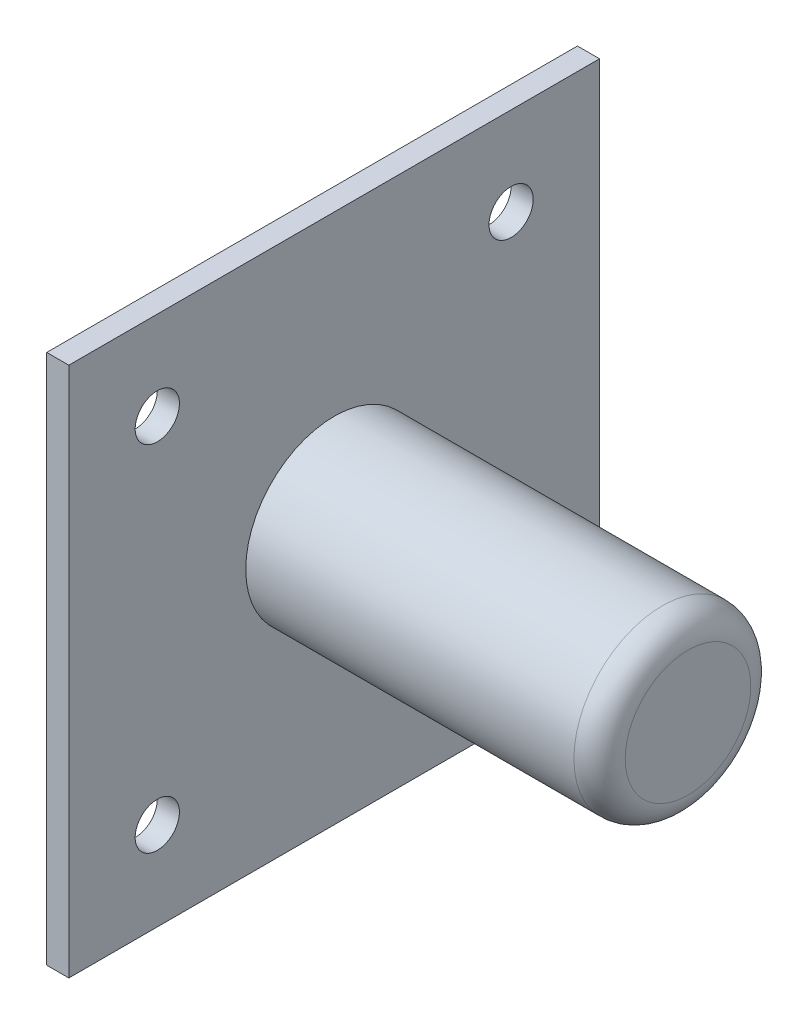
ISO-10303-21;
HEADER;
FILE_DESCRIPTION(('STEP AP214'),'2;1');
FILE_NAME('part.step','',(''),(''),'','','');
FILE_SCHEMA(('AUTOMOTIVE_DESIGN { 1 0 10303 214 1 1 1 1 }'));
ENDSEC;
DATA;
#1=APPLICATION_CONTEXT('core data for automotive mechanical design processes');
#2=APPLICATION_PROTOCOL_DEFINITION('international standard','automotive_design',2000,#1);
#3=PRODUCT_CONTEXT('',#1,'mechanical');
#4=PRODUCT('Part','Part','',(#3));
#5=PRODUCT_RELATED_PRODUCT_CATEGORY('part','',(#4));
#6=PRODUCT_DEFINITION_FORMATION('','',#4);
#7=PRODUCT_DEFINITION_CONTEXT('part definition',#1,'design');
#8=PRODUCT_DEFINITION('design','',#6,#7);
#9=PRODUCT_DEFINITION_SHAPE('','',#8);
#10=(LENGTH_UNIT() NAMED_UNIT(*) SI_UNIT(.MILLI.,.METRE.));
#11=(NAMED_UNIT(*) PLANE_ANGLE_UNIT() SI_UNIT($,.RADIAN.));
#12=(NAMED_UNIT(*) SI_UNIT($,.STERADIAN.) SOLID_ANGLE_UNIT());
#13=UNCERTAINTY_MEASURE_WITH_UNIT(LENGTH_MEASURE(1.E-05),#10,'distance_accuracy_value','');
#14=(GEOMETRIC_REPRESENTATION_CONTEXT(3) GLOBAL_UNCERTAINTY_ASSIGNED_CONTEXT((#13)) GLOBAL_UNIT_ASSIGNED_CONTEXT((#10,
#11,#12)) REPRESENTATION_CONTEXT('',''));
#15=CARTESIAN_POINT('',(0.,0.,0.));
#16=DIRECTION('',(0.,0.,1.));
#17=DIRECTION('',(1.,0.,0.));
#18=AXIS2_PLACEMENT_3D('',#15,#16,#17);
#19=CARTESIAN_POINT('',(1.5875,38.1,-38.1));
#20=DIRECTION('',(-1.,0.,0.));
#21=DIRECTION('',(0.,0.,1.));
#22=AXIS2_PLACEMENT_3D('',#19,#20,#21);
#23=PLANE('',#22);
#24=CARTESIAN_POINT('',(1.5875,0.,0.));
#25=DIRECTION('',(-1.,0.,0.));
#26=DIRECTION('',(0.,0.,1.));
#27=AXIS2_PLACEMENT_3D('',#24,#25,#26);
#28=CIRCLE('',#27,12.7);
#29=CARTESIAN_POINT('',(1.5875,0.,12.7));
#30=VERTEX_POINT('',#29);
#31=EDGE_CURVE('E176',#30,#30,#28,.T.);
#32=ORIENTED_EDGE('',*,*,#31,.T.);
#33=EDGE_LOOP('',(#32));
#34=FACE_BOUND('',#33,.T.);
#35=CARTESIAN_POINT('',(1.5875,-25.4,-25.4));
#36=DIRECTION('',(1.,0.,0.));
#37=DIRECTION('',(0.,0.,-1.));
#38=AXIS2_PLACEMENT_3D('',#35,#36,#37);
#39=CIRCLE('',#38,3.175);
#40=CARTESIAN_POINT('',(1.5875,-25.4,-28.575));
#41=VERTEX_POINT('',#40);
#42=EDGE_CURVE('E150',#41,#41,#39,.T.);
#43=ORIENTED_EDGE('',*,*,#42,.F.);
#44=EDGE_LOOP('',(#43));
#45=FACE_BOUND('',#44,.T.);
#46=CARTESIAN_POINT('',(1.5875,25.4,25.4));
#47=DIRECTION('',(1.,0.,0.));
#48=DIRECTION('',(0.,0.,-1.));
#49=AXIS2_PLACEMENT_3D('',#46,#47,#48);
#50=CIRCLE('',#49,3.175);
#51=CARTESIAN_POINT('',(1.5875,25.4,22.225));
#52=VERTEX_POINT('',#51);
#53=EDGE_CURVE('E120',#52,#52,#50,.T.);
#54=ORIENTED_EDGE('',*,*,#53,.F.);
#55=EDGE_LOOP('',(#54));
#56=FACE_BOUND('',#55,.T.);
#57=DIRECTION('',(0.,1.,0.));
#58=VECTOR('',#57,1.);
#59=CARTESIAN_POINT('',(1.5875,-38.1,-38.1));
#60=LINE('',#59,#58);
#61=CARTESIAN_POINT('',(1.5875,-38.1,-38.1));
#62=VERTEX_POINT('',#61);
#63=CARTESIAN_POINT('',(1.5875,38.1,-38.1));
#64=VERTEX_POINT('',#63);
#65=EDGE_CURVE('E99',#62,#64,#60,.T.);
#66=ORIENTED_EDGE('',*,*,#65,.T.);
#67=DIRECTION('',(0.,0.,1.));
#68=VECTOR('',#67,1.);
#69=CARTESIAN_POINT('',(1.5875,38.1,38.1));
#70=LINE('',#69,#68);
#71=CARTESIAN_POINT('',(1.5875,38.1,38.1));
#72=VERTEX_POINT('',#71);
#73=EDGE_CURVE('E93',#64,#72,#70,.T.);
#74=ORIENTED_EDGE('',*,*,#73,.T.);
#75=DIRECTION('',(0.,-1.,0.));
#76=VECTOR('',#75,1.);
#77=CARTESIAN_POINT('',(1.5875,-38.1,38.1));
#78=LINE('',#77,#76);
#79=CARTESIAN_POINT('',(1.5875,-38.1,38.1));
#80=VERTEX_POINT('',#79);
#81=EDGE_CURVE('E97',#72,#80,#78,.T.);
#82=ORIENTED_EDGE('',*,*,#81,.T.);
#83=DIRECTION('',(0.,0.,-1.));
#84=VECTOR('',#83,1.);
#85=CARTESIAN_POINT('',(1.5875,-38.1,38.1));
#86=LINE('',#85,#84);
#87=EDGE_CURVE('E61',#80,#62,#86,.T.);
#88=ORIENTED_EDGE('',*,*,#87,.T.);
#89=EDGE_LOOP('',(#66,#74,#82,#88));
#90=FACE_BOUND('',#89,.T.);
#91=CARTESIAN_POINT('',(1.5875,25.4,-25.4));
#92=DIRECTION('',(1.,0.,0.));
#93=DIRECTION('',(0.,0.,-1.));
#94=AXIS2_PLACEMENT_3D('',#91,#92,#93);
#95=CIRCLE('',#94,3.175);
#96=CARTESIAN_POINT('',(1.5875,25.4,-28.575));
#97=VERTEX_POINT('',#96);
#98=EDGE_CURVE('E142',#97,#97,#95,.T.);
#99=ORIENTED_EDGE('',*,*,#98,.F.);
#100=EDGE_LOOP('',(#99));
#101=FACE_BOUND('',#100,.T.);
#102=CARTESIAN_POINT('',(1.5875,-25.4,25.4));
#103=DIRECTION('',(1.,0.,0.));
#104=DIRECTION('',(0.,0.,-1.));
#105=AXIS2_PLACEMENT_3D('',#102,#103,#104);
#106=CIRCLE('',#105,3.175);
#107=CARTESIAN_POINT('',(1.5875,-25.4,22.225));
#108=VERTEX_POINT('',#107);
#109=EDGE_CURVE('E157',#108,#108,#106,.T.);
#110=ORIENTED_EDGE('',*,*,#109,.F.);
#111=EDGE_LOOP('',(#110));
#112=FACE_BOUND('',#111,.T.);
#113=ADVANCED_FACE('F41',(#34,#45,#56,#90,#101,#112),#23,.F.);
#114=CARTESIAN_POINT('',(-1.5875,38.1,-38.1));
#115=DIRECTION('',(-1.,0.,0.));
#116=DIRECTION('',(0.,0.,1.));
#117=AXIS2_PLACEMENT_3D('',#114,#115,#116);
#118=PLANE('',#117);
#119=CARTESIAN_POINT('',(-1.5875,-25.4,-25.4));
#120=DIRECTION('',(1.,0.,0.));
#121=DIRECTION('',(0.,0.,-1.));
#122=AXIS2_PLACEMENT_3D('',#119,#120,#121);
#123=CIRCLE('',#122,3.175);
#124=CARTESIAN_POINT('',(-1.5875,-25.4,-28.575));
#125=VERTEX_POINT('',#124);
#126=EDGE_CURVE('E154',#125,#125,#123,.T.);
#127=ORIENTED_EDGE('',*,*,#126,.T.);
#128=EDGE_LOOP('',(#127));
#129=FACE_BOUND('',#128,.T.);
#130=CARTESIAN_POINT('',(-1.5875,25.4,25.4));
#131=DIRECTION('',(1.,0.,0.));
#132=DIRECTION('',(0.,0.,-1.));
#133=AXIS2_PLACEMENT_3D('',#130,#131,#132);
#134=CIRCLE('',#133,3.175);
#135=CARTESIAN_POINT('',(-1.5875,25.4,22.225));
#136=VERTEX_POINT('',#135);
#137=EDGE_CURVE('E138',#136,#136,#134,.T.);
#138=ORIENTED_EDGE('',*,*,#137,.T.);
#139=EDGE_LOOP('',(#138));
#140=FACE_BOUND('',#139,.T.);
#141=DIRECTION('',(0.,1.,0.));
#142=VECTOR('',#141,1.);
#143=CARTESIAN_POINT('',(-1.5875,-38.1,-38.1));
#144=LINE('',#143,#142);
#145=CARTESIAN_POINT('',(-1.5875,-38.1,-38.1));
#146=VERTEX_POINT('',#145);
#147=CARTESIAN_POINT('',(-1.5875,38.1,-38.1));
#148=VERTEX_POINT('',#147);
#149=EDGE_CURVE('E116',#146,#148,#144,.T.);
#150=ORIENTED_EDGE('',*,*,#149,.F.);
#151=DIRECTION('',(0.,0.,-1.));
#152=VECTOR('',#151,1.);
#153=CARTESIAN_POINT('',(-1.5875,-38.1,38.1));
#154=LINE('',#153,#152);
#155=CARTESIAN_POINT('',(-1.5875,-38.1,38.1));
#156=VERTEX_POINT('',#155);
#157=EDGE_CURVE('E86',#156,#146,#154,.T.);
#158=ORIENTED_EDGE('',*,*,#157,.F.);
#159=DIRECTION('',(0.,-1.,0.));
#160=VECTOR('',#159,1.);
#161=CARTESIAN_POINT('',(-1.5875,-38.1,38.1));
#162=LINE('',#161,#160);
#163=CARTESIAN_POINT('',(-1.5875,38.1,38.1));
#164=VERTEX_POINT('',#163);
#165=EDGE_CURVE('E80',#164,#156,#162,.T.);
#166=ORIENTED_EDGE('',*,*,#165,.F.);
#167=DIRECTION('',(0.,0.,1.));
#168=VECTOR('',#167,1.);
#169=CARTESIAN_POINT('',(-1.5875,38.1,38.1));
#170=LINE('',#169,#168);
#171=EDGE_CURVE('E104',#148,#164,#170,.T.);
#172=ORIENTED_EDGE('',*,*,#171,.F.);
#173=EDGE_LOOP('',(#150,#158,#166,#172));
#174=FACE_BOUND('',#173,.T.);
#175=CARTESIAN_POINT('',(-1.5875,25.4,-25.4));
#176=DIRECTION('',(1.,0.,0.));
#177=DIRECTION('',(0.,0.,-1.));
#178=AXIS2_PLACEMENT_3D('',#175,#176,#177);
#179=CIRCLE('',#178,3.175);
#180=CARTESIAN_POINT('',(-1.5875,25.4,-28.575));
#181=VERTEX_POINT('',#180);
#182=EDGE_CURVE('E146',#181,#181,#179,.T.);
#183=ORIENTED_EDGE('',*,*,#182,.T.);
#184=EDGE_LOOP('',(#183));
#185=FACE_BOUND('',#184,.T.);
#186=CARTESIAN_POINT('',(-1.5875,-25.4,25.4));
#187=DIRECTION('',(1.,0.,0.));
#188=DIRECTION('',(0.,0.,-1.));
#189=AXIS2_PLACEMENT_3D('',#186,#187,#188);
#190=CIRCLE('',#189,3.175);
#191=CARTESIAN_POINT('',(-1.5875,-25.4,22.225));
#192=VERTEX_POINT('',#191);
#193=EDGE_CURVE('E161',#192,#192,#190,.T.);
#194=ORIENTED_EDGE('',*,*,#193,.T.);
#195=EDGE_LOOP('',(#194));
#196=FACE_BOUND('',#195,.T.);
#197=ADVANCED_FACE('F132',(#129,#140,#174,#185,#196),#118,.T.);
#198=CARTESIAN_POINT('',(1.5875,-38.1,-38.1));
#199=DIRECTION('',(0.,0.,1.));
#200=DIRECTION('',(1.,0.,0.));
#201=AXIS2_PLACEMENT_3D('',#198,#199,#200);
#202=PLANE('',#201);
#203=ORIENTED_EDGE('',*,*,#149,.T.);
#204=DIRECTION('',(-1.,0.,0.));
#205=VECTOR('',#204,1.);
#206=CARTESIAN_POINT('',(1.5875,38.1,-38.1));
#207=LINE('',#206,#205);
#208=EDGE_CURVE('E11',#64,#148,#207,.T.);
#209=ORIENTED_EDGE('',*,*,#208,.F.);
#210=ORIENTED_EDGE('',*,*,#65,.F.);
#211=DIRECTION('',(-1.,0.,0.));
#212=VECTOR('',#211,1.);
#213=CARTESIAN_POINT('',(1.5875,-38.1,-38.1));
#214=LINE('',#213,#212);
#215=EDGE_CURVE('E112',#62,#146,#214,.T.);
#216=ORIENTED_EDGE('',*,*,#215,.T.);
#217=EDGE_LOOP('',(#203,#209,#210,#216));
#218=FACE_BOUND('',#217,.T.);
#219=ADVANCED_FACE('F43',(#218),#202,.F.);
#220=CARTESIAN_POINT('',(1.5875,38.1,38.1));
#221=DIRECTION('',(0.,-1.,0.));
#222=DIRECTION('',(0.,0.,-1.));
#223=AXIS2_PLACEMENT_3D('',#220,#221,#222);
#224=PLANE('',#223);
#225=ORIENTED_EDGE('',*,*,#171,.T.);
#226=DIRECTION('',(-1.,0.,0.));
#227=VECTOR('',#226,1.);
#228=CARTESIAN_POINT('',(1.5875,38.1,38.1));
#229=LINE('',#228,#227);
#230=EDGE_CURVE('E50',#72,#164,#229,.T.);
#231=ORIENTED_EDGE('',*,*,#230,.F.);
#232=ORIENTED_EDGE('',*,*,#73,.F.);
#233=ORIENTED_EDGE('',*,*,#208,.T.);
#234=EDGE_LOOP('',(#225,#231,#232,#233));
#235=FACE_BOUND('',#234,.T.);
#236=ADVANCED_FACE('F103',(#235),#224,.F.);
#237=CARTESIAN_POINT('',(1.5875,-38.1,38.1));
#238=DIRECTION('',(0.,0.,-1.));
#239=DIRECTION('',(-1.,0.,0.));
#240=AXIS2_PLACEMENT_3D('',#237,#238,#239);
#241=PLANE('',#240);
#242=ORIENTED_EDGE('',*,*,#165,.T.);
#243=DIRECTION('',(-1.,0.,0.));
#244=VECTOR('',#243,1.);
#245=CARTESIAN_POINT('',(1.5875,-38.1,38.1));
#246=LINE('',#245,#244);
#247=EDGE_CURVE('E106',#80,#156,#246,.T.);
#248=ORIENTED_EDGE('',*,*,#247,.F.);
#249=ORIENTED_EDGE('',*,*,#81,.F.);
#250=ORIENTED_EDGE('',*,*,#230,.T.);
#251=EDGE_LOOP('',(#242,#248,#249,#250));
#252=FACE_BOUND('',#251,.T.);
#253=ADVANCED_FACE('F107',(#252),#241,.F.);
#254=CARTESIAN_POINT('',(1.5875,-38.1,38.1));
#255=DIRECTION('',(0.,1.,0.));
#256=DIRECTION('',(0.,0.,1.));
#257=AXIS2_PLACEMENT_3D('',#254,#255,#256);
#258=PLANE('',#257);
#259=ORIENTED_EDGE('',*,*,#157,.T.);
#260=ORIENTED_EDGE('',*,*,#215,.F.);
#261=ORIENTED_EDGE('',*,*,#87,.F.);
#262=ORIENTED_EDGE('',*,*,#247,.T.);
#263=EDGE_LOOP('',(#259,#260,#261,#262));
#264=FACE_BOUND('',#263,.T.);
#265=ADVANCED_FACE('F129',(#264),#258,.F.);
#266=CARTESIAN_POINT('',(1.5875,25.4,25.4));
#267=DIRECTION('',(-1.,0.,0.));
#268=DIRECTION('',(0.,0.,1.));
#269=AXIS2_PLACEMENT_3D('',#266,#267,#268);
#270=CYLINDRICAL_SURFACE('',#269,3.175);
#271=ORIENTED_EDGE('',*,*,#53,.T.);
#272=EDGE_LOOP('',(#271));
#273=FACE_BOUND('',#272,.T.);
#274=ORIENTED_EDGE('',*,*,#137,.F.);
#275=EDGE_LOOP('',(#274));
#276=FACE_BOUND('',#275,.T.);
#277=ADVANCED_FACE('F202',(#273,#276),#270,.F.);
#278=CARTESIAN_POINT('',(1.5875,25.4,-25.4));
#279=DIRECTION('',(-1.,0.,0.));
#280=DIRECTION('',(0.,0.,1.));
#281=AXIS2_PLACEMENT_3D('',#278,#279,#280);
#282=CYLINDRICAL_SURFACE('',#281,3.175);
#283=ORIENTED_EDGE('',*,*,#98,.T.);
#284=EDGE_LOOP('',(#283));
#285=FACE_BOUND('',#284,.T.);
#286=ORIENTED_EDGE('',*,*,#182,.F.);
#287=EDGE_LOOP('',(#286));
#288=FACE_BOUND('',#287,.T.);
#289=ADVANCED_FACE('F266',(#285,#288),#282,.F.);
#290=CARTESIAN_POINT('',(1.5875,-25.4,-25.4));
#291=DIRECTION('',(-1.,0.,0.));
#292=DIRECTION('',(0.,0.,1.));
#293=AXIS2_PLACEMENT_3D('',#290,#291,#292);
#294=CYLINDRICAL_SURFACE('',#293,3.175);
#295=ORIENTED_EDGE('',*,*,#42,.T.);
#296=EDGE_LOOP('',(#295));
#297=FACE_BOUND('',#296,.T.);
#298=ORIENTED_EDGE('',*,*,#126,.F.);
#299=EDGE_LOOP('',(#298));
#300=FACE_BOUND('',#299,.T.);
#301=ADVANCED_FACE('F257',(#297,#300),#294,.F.);
#302=CARTESIAN_POINT('',(1.5875,-25.4,25.4));
#303=DIRECTION('',(-1.,0.,0.));
#304=DIRECTION('',(0.,0.,1.));
#305=AXIS2_PLACEMENT_3D('',#302,#303,#304);
#306=CYLINDRICAL_SURFACE('',#305,3.175);
#307=ORIENTED_EDGE('',*,*,#109,.T.);
#308=EDGE_LOOP('',(#307));
#309=FACE_BOUND('',#308,.T.);
#310=ORIENTED_EDGE('',*,*,#193,.F.);
#311=EDGE_LOOP('',(#310));
#312=FACE_BOUND('',#311,.T.);
#313=ADVANCED_FACE('F232',(#309,#312),#306,.F.);
#314=CARTESIAN_POINT('',(52.3875,70.3859553544678,-4.9150249927354E-13));
#315=DIRECTION('',(1.,0.,0.));
#316=DIRECTION('',(0.,0.,-1.));
#317=AXIS2_PLACEMENT_3D('',#314,#315,#316);
#318=PLANE('',#317);
#319=CARTESIAN_POINT('',(52.3875,0.,0.));
#320=DIRECTION('',(-1.,0.,0.));
#321=DIRECTION('',(0.,0.,1.));
#322=AXIS2_PLACEMENT_3D('',#319,#320,#321);
#323=CIRCLE('',#322,9.01670202004494);
#324=CARTESIAN_POINT('',(52.3875,0.,9.01670202004494));
#325=VERTEX_POINT('',#324);
#326=EDGE_CURVE('E165',#325,#325,#323,.T.);
#327=ORIENTED_EDGE('',*,*,#326,.F.);
#328=EDGE_LOOP('',(#327));
#329=FACE_BOUND('',#328,.T.);
#330=ADVANCED_FACE('F191',(#329),#318,.T.);
#331=CARTESIAN_POINT('',(48.7042020200449,0.,0.));
#332=DIRECTION('',(-1.,0.,0.));
#333=DIRECTION('',(0.,0.,1.));
#334=AXIS2_PLACEMENT_3D('',#331,#332,#333);
#335=TOROIDAL_SURFACE('',#334,9.01670202004494,3.68329797995508);
#336=ORIENTED_EDGE('',*,*,#326,.T.);
#337=EDGE_LOOP('',(#336));
#338=FACE_BOUND('',#337,.T.);
#339=CARTESIAN_POINT('',(48.7042020200449,0.,0.));
#340=DIRECTION('',(-1.,0.,0.));
#341=DIRECTION('',(0.,0.,1.));
#342=AXIS2_PLACEMENT_3D('',#339,#340,#341);
#343=CIRCLE('',#342,12.7);
#344=CARTESIAN_POINT('',(48.7042020200449,0.,12.7));
#345=VERTEX_POINT('',#344);
#346=EDGE_CURVE('E172',#345,#345,#343,.T.);
#347=ORIENTED_EDGE('',*,*,#346,.F.);
#348=EDGE_LOOP('',(#347));
#349=FACE_BOUND('',#348,.T.);
#350=ADVANCED_FACE('F185',(#338,#349),#335,.T.);
#351=CARTESIAN_POINT('',(1.5875,0.,0.));
#352=DIRECTION('',(-1.,0.,0.));
#353=DIRECTION('',(0.,0.,1.));
#354=AXIS2_PLACEMENT_3D('',#351,#352,#353);
#355=CYLINDRICAL_SURFACE('',#354,12.7);
#356=ORIENTED_EDGE('',*,*,#346,.T.);
#357=EDGE_LOOP('',(#356));
#358=FACE_BOUND('',#357,.T.);
#359=ORIENTED_EDGE('',*,*,#31,.F.);
#360=EDGE_LOOP('',(#359));
#361=FACE_BOUND('',#360,.T.);
#362=ADVANCED_FACE('F183',(#358,#361),#355,.T.);
#363=CLOSED_SHELL('',(#113,#197,#219,#236,#253,#265,#277,#289,#301,#313,#330,#350,#362));
#364=MANIFOLD_SOLID_BREP('B2',#363);
#365=ADVANCED_BREP_SHAPE_REPRESENTATION('',(#18,#364),#14);
#366=SHAPE_DEFINITION_REPRESENTATION(#9,#365);
ENDSEC;
END-ISO-10303-21;
